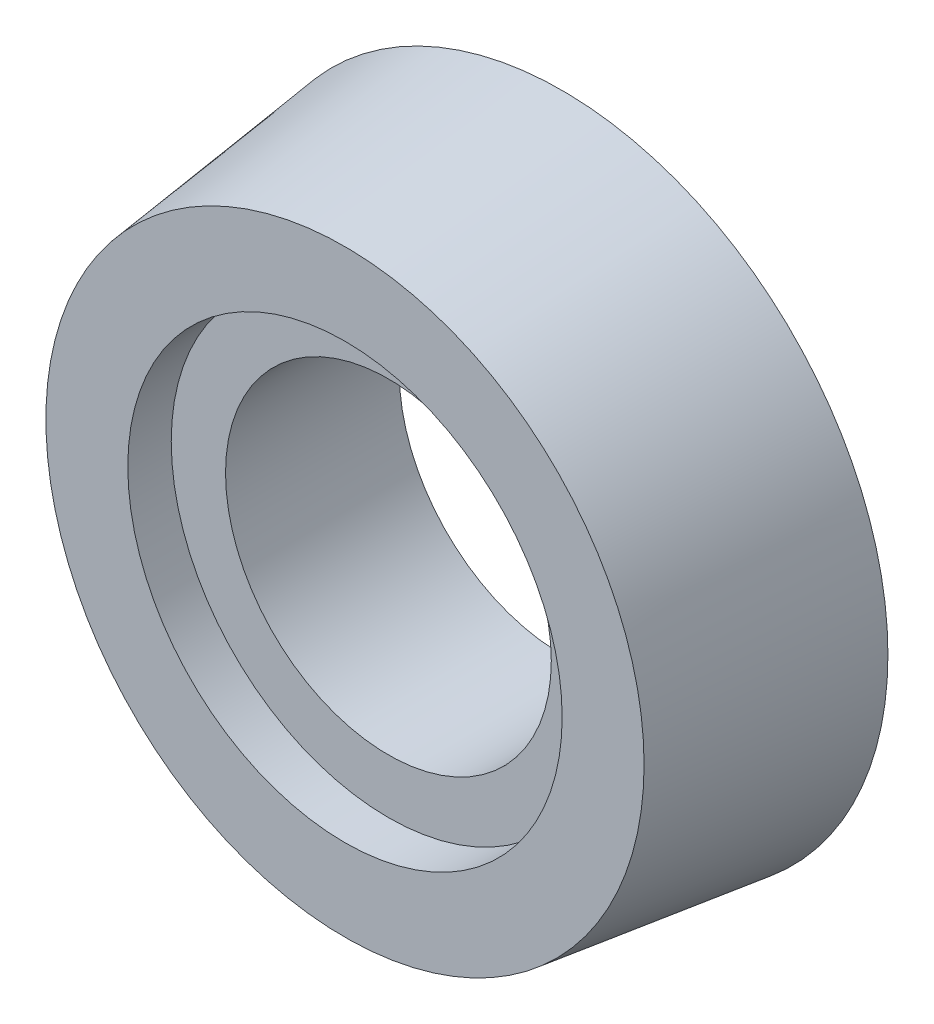
ISO-10303-21;
HEADER;
FILE_DESCRIPTION(('STEP AP214'),'2;1');
FILE_NAME('part.step','',(''),(''),'','','');
FILE_SCHEMA(('AUTOMOTIVE_DESIGN { 1 0 10303 214 1 1 1 1 }'));
ENDSEC;
DATA;
#1=APPLICATION_CONTEXT('core data for automotive mechanical design processes');
#2=APPLICATION_PROTOCOL_DEFINITION('international standard','automotive_design',2000,#1);
#3=PRODUCT_CONTEXT('',#1,'mechanical');
#4=PRODUCT('Part','Part','',(#3));
#5=PRODUCT_RELATED_PRODUCT_CATEGORY('part','',(#4));
#6=PRODUCT_DEFINITION_FORMATION('','',#4);
#7=PRODUCT_DEFINITION_CONTEXT('part definition',#1,'design');
#8=PRODUCT_DEFINITION('design','',#6,#7);
#9=PRODUCT_DEFINITION_SHAPE('','',#8);
#10=(LENGTH_UNIT() NAMED_UNIT(*) SI_UNIT(.MILLI.,.METRE.));
#11=(NAMED_UNIT(*) PLANE_ANGLE_UNIT() SI_UNIT($,.RADIAN.));
#12=(NAMED_UNIT(*) SI_UNIT($,.STERADIAN.) SOLID_ANGLE_UNIT());
#13=UNCERTAINTY_MEASURE_WITH_UNIT(LENGTH_MEASURE(1.E-05),#10,'distance_accuracy_value','');
#14=(GEOMETRIC_REPRESENTATION_CONTEXT(3) GLOBAL_UNCERTAINTY_ASSIGNED_CONTEXT((#13)) GLOBAL_UNIT_ASSIGNED_CONTEXT((#10,
#11,#12)) REPRESENTATION_CONTEXT('',''));
#15=CARTESIAN_POINT('',(0.,0.,0.));
#16=DIRECTION('',(0.,0.,1.));
#17=DIRECTION('',(1.,0.,0.));
#18=AXIS2_PLACEMENT_3D('',#15,#16,#17);
#19=CARTESIAN_POINT('',(0.,0.,20.));
#20=DIRECTION('',(0.,0.,-1.));
#21=DIRECTION('',(-1.,0.,0.));
#22=AXIS2_PLACEMENT_3D('',#19,#20,#21);
#23=CYLINDRICAL_SURFACE('',#22,15.);
#24=CARTESIAN_POINT('',(0.,0.,0.));
#25=DIRECTION('',(0.,0.,-1.));
#26=DIRECTION('',(-1.,0.,0.));
#27=AXIS2_PLACEMENT_3D('',#24,#25,#26);
#28=CIRCLE('',#27,15.);
#29=CARTESIAN_POINT('',(-15.,0.,0.));
#30=VERTEX_POINT('',#29);
#31=EDGE_CURVE('E45',#30,#30,#28,.T.);
#32=ORIENTED_EDGE('',*,*,#31,.T.);
#33=EDGE_LOOP('',(#32));
#34=FACE_BOUND('',#33,.T.);
#35=CARTESIAN_POINT('',(0.,0.,16.));
#36=DIRECTION('',(0.,0.,1.));
#37=DIRECTION('',(1.,0.,0.));
#38=AXIS2_PLACEMENT_3D('',#35,#36,#37);
#39=CIRCLE('',#38,15.);
#40=CARTESIAN_POINT('',(15.,0.,16.));
#41=VERTEX_POINT('',#40);
#42=EDGE_CURVE('E37',#41,#41,#39,.F.);
#43=ORIENTED_EDGE('',*,*,#42,.F.);
#44=EDGE_LOOP('',(#43));
#45=FACE_BOUND('',#44,.T.);
#46=ADVANCED_FACE('F33',(#34,#45),#23,.F.);
#47=CARTESIAN_POINT('',(0.,0.,0.));
#48=DIRECTION('',(0.,0.,-1.));
#49=DIRECTION('',(1.,0.,0.));
#50=AXIS2_PLACEMENT_3D('',#47,#48,#49);
#51=CONICAL_SURFACE('',#50,30.,0.122173047639603);
#52=CARTESIAN_POINT('',(0.,0.,20.));
#53=DIRECTION('',(0.,0.,1.));
#54=DIRECTION('',(1.,0.,0.));
#55=AXIS2_PLACEMENT_3D('',#52,#53,#54);
#56=CIRCLE('',#55,27.5443087819419);
#57=CARTESIAN_POINT('',(27.5443087819419,0.,20.));
#58=VERTEX_POINT('',#57);
#59=EDGE_CURVE('E10',#58,#58,#56,.T.);
#60=ORIENTED_EDGE('',*,*,#59,.F.);
#61=EDGE_LOOP('',(#60));
#62=FACE_BOUND('',#61,.T.);
#63=CARTESIAN_POINT('',(0.,0.,0.));
#64=DIRECTION('',(0.,0.,1.));
#65=DIRECTION('',(1.,0.,0.));
#66=AXIS2_PLACEMENT_3D('',#63,#64,#65);
#67=CIRCLE('',#66,30.);
#68=CARTESIAN_POINT('',(30.,0.,0.));
#69=VERTEX_POINT('',#68);
#70=EDGE_CURVE('E41',#69,#69,#67,.T.);
#71=ORIENTED_EDGE('',*,*,#70,.T.);
#72=EDGE_LOOP('',(#71));
#73=FACE_BOUND('',#72,.T.);
#74=ADVANCED_FACE('F35',(#62,#73),#51,.T.);
#75=CARTESIAN_POINT('',(0.,0.,20.));
#76=DIRECTION('',(0.,0.,1.));
#77=DIRECTION('',(1.,0.,0.));
#78=AXIS2_PLACEMENT_3D('',#75,#76,#77);
#79=PLANE('',#78);
#80=CARTESIAN_POINT('',(0.,0.,20.));
#81=DIRECTION('',(0.,0.,1.));
#82=DIRECTION('',(1.,0.,0.));
#83=AXIS2_PLACEMENT_3D('',#80,#81,#82);
#84=CIRCLE('',#83,20.);
#85=CARTESIAN_POINT('',(20.,0.,20.));
#86=VERTEX_POINT('',#85);
#87=EDGE_CURVE('E50',#86,#86,#84,.T.);
#88=ORIENTED_EDGE('',*,*,#87,.F.);
#89=EDGE_LOOP('',(#88));
#90=FACE_BOUND('',#89,.T.);
#91=ORIENTED_EDGE('',*,*,#59,.T.);
#92=EDGE_LOOP('',(#91));
#93=FACE_BOUND('',#92,.T.);
#94=ADVANCED_FACE('F70',(#90,#93),#79,.T.);
#95=CARTESIAN_POINT('',(0.,0.,0.));
#96=DIRECTION('',(0.,0.,1.));
#97=DIRECTION('',(1.,0.,0.));
#98=AXIS2_PLACEMENT_3D('',#95,#96,#97);
#99=PLANE('',#98);
#100=ORIENTED_EDGE('',*,*,#31,.F.);
#101=EDGE_LOOP('',(#100));
#102=FACE_BOUND('',#101,.T.);
#103=ORIENTED_EDGE('',*,*,#70,.F.);
#104=EDGE_LOOP('',(#103));
#105=FACE_BOUND('',#104,.T.);
#106=ADVANCED_FACE('F76',(#102,#105),#99,.F.);
#107=CARTESIAN_POINT('',(0.,0.,16.));
#108=DIRECTION('',(0.,0.,1.));
#109=DIRECTION('',(1.,0.,0.));
#110=AXIS2_PLACEMENT_3D('',#107,#108,#109);
#111=PLANE('',#110);
#112=CARTESIAN_POINT('',(0.,0.,16.));
#113=DIRECTION('',(0.,0.,1.));
#114=DIRECTION('',(1.,0.,0.));
#115=AXIS2_PLACEMENT_3D('',#112,#113,#114);
#116=CIRCLE('',#115,20.);
#117=CARTESIAN_POINT('',(20.,0.,16.));
#118=VERTEX_POINT('',#117);
#119=EDGE_CURVE('E53',#118,#118,#116,.T.);
#120=ORIENTED_EDGE('',*,*,#119,.T.);
#121=EDGE_LOOP('',(#120));
#122=FACE_BOUND('',#121,.T.);
#123=ORIENTED_EDGE('',*,*,#42,.T.);
#124=EDGE_LOOP('',(#123));
#125=FACE_BOUND('',#124,.T.);
#126=ADVANCED_FACE('F60',(#122,#125),#111,.T.);
#127=CARTESIAN_POINT('',(0.,0.,16.));
#128=DIRECTION('',(0.,0.,1.));
#129=DIRECTION('',(1.,0.,0.));
#130=AXIS2_PLACEMENT_3D('',#127,#128,#129);
#131=CYLINDRICAL_SURFACE('',#130,20.);
#132=ORIENTED_EDGE('',*,*,#119,.F.);
#133=EDGE_LOOP('',(#132));
#134=FACE_BOUND('',#133,.T.);
#135=ORIENTED_EDGE('',*,*,#87,.T.);
#136=EDGE_LOOP('',(#135));
#137=FACE_BOUND('',#136,.T.);
#138=ADVANCED_FACE('F74',(#134,#137),#131,.F.);
#139=CLOSED_SHELL('',(#46,#74,#94,#106,#126,#138));
#140=MANIFOLD_SOLID_BREP('B2',#139);
#141=ADVANCED_BREP_SHAPE_REPRESENTATION('',(#18,#140),#14);
#142=SHAPE_DEFINITION_REPRESENTATION(#9,#141);
ENDSEC;
END-ISO-10303-21;
